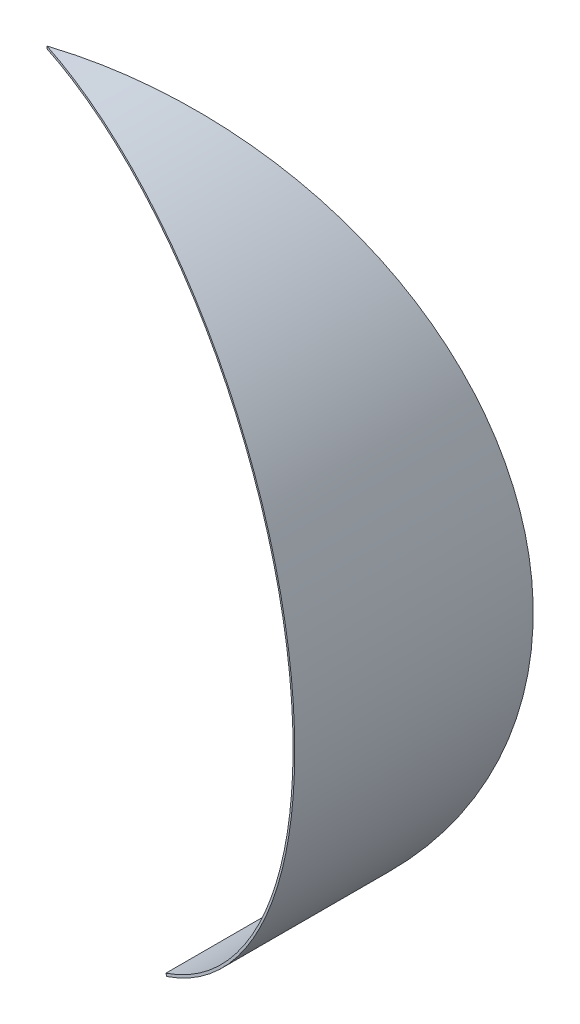
ISO-10303-21;
HEADER;
FILE_DESCRIPTION(('STEP AP214'),'2;1');
FILE_NAME('part.step','',(''),(''),'','','');
FILE_SCHEMA(('AUTOMOTIVE_DESIGN { 1 0 10303 214 1 1 1 1 }'));
ENDSEC;
DATA;
#1=APPLICATION_CONTEXT('core data for automotive mechanical design processes');
#2=APPLICATION_PROTOCOL_DEFINITION('international standard','automotive_design',2000,#1);
#3=PRODUCT_CONTEXT('',#1,'mechanical');
#4=PRODUCT('Part','Part','',(#3));
#5=PRODUCT_RELATED_PRODUCT_CATEGORY('part','',(#4));
#6=PRODUCT_DEFINITION_FORMATION('','',#4);
#7=PRODUCT_DEFINITION_CONTEXT('part definition',#1,'design');
#8=PRODUCT_DEFINITION('design','',#6,#7);
#9=PRODUCT_DEFINITION_SHAPE('','',#8);
#10=(LENGTH_UNIT() NAMED_UNIT(*) SI_UNIT(.MILLI.,.METRE.));
#11=(NAMED_UNIT(*) PLANE_ANGLE_UNIT() SI_UNIT($,.RADIAN.));
#12=(NAMED_UNIT(*) SI_UNIT($,.STERADIAN.) SOLID_ANGLE_UNIT());
#13=UNCERTAINTY_MEASURE_WITH_UNIT(LENGTH_MEASURE(1.E-05),#10,'distance_accuracy_value','');
#14=(GEOMETRIC_REPRESENTATION_CONTEXT(3) GLOBAL_UNCERTAINTY_ASSIGNED_CONTEXT((#13)) GLOBAL_UNIT_ASSIGNED_CONTEXT((#10,
#11,#12)) REPRESENTATION_CONTEXT('',''));
#15=CARTESIAN_POINT('',(0.,0.,0.));
#16=DIRECTION('',(0.,0.,1.));
#17=DIRECTION('',(1.,0.,0.));
#18=AXIS2_PLACEMENT_3D('',#15,#16,#17);
#19=CARTESIAN_POINT('',(0.,0.,1500.));
#20=DIRECTION('',(0.,0.,-1.));
#21=DIRECTION('',(-1.,0.,0.));
#22=AXIS2_PLACEMENT_3D('',#19,#20,#21);
#23=CYLINDRICAL_SURFACE('',#22,2980.);
#24=CARTESIAN_POINT('',(0.,0.,-6.66133814775094E-13));
#25=DIRECTION('',(-0.309016994374935,0.,-0.951056516295158));
#26=DIRECTION('',(0.951056516295158,0.,-0.309016994374935));
#27=AXIS2_PLACEMENT_3D('',#24,#25,#26);
#28=ELLIPSE('',#27,3133.35742823002,2980.);
#29=CARTESIAN_POINT('',(1440.33333333333,-2608.80046935155,-467.992669140776));
#30=VERTEX_POINT('',#29);
#31=CARTESIAN_POINT('',(1.83697019872103E-13,2980.,0.));
#32=VERTEX_POINT('',#31);
#33=EDGE_CURVE('E80',#30,#32,#28,.F.);
#34=ORIENTED_EDGE('',*,*,#33,.F.);
#35=DIRECTION('',(0.,0.,-1.));
#36=VECTOR('',#35,1.);
#37=CARTESIAN_POINT('',(1440.33333333333,-2608.80046935155,1500.));
#38=LINE('',#37,#36);
#39=CARTESIAN_POINT('',(1440.33333333333,-2608.80046935155,467.992669140819));
#40=VERTEX_POINT('',#39);
#41=EDGE_CURVE('E11',#40,#30,#38,.T.);
#42=ORIENTED_EDGE('',*,*,#41,.F.);
#43=CARTESIAN_POINT('',(0.,0.,-2.22044604925031E-13));
#44=DIRECTION('',(-0.309016994374961,0.,0.951056516295149));
#45=DIRECTION('',(-0.951056516295149,0.,-0.309016994374961));
#46=AXIS2_PLACEMENT_3D('',#43,#44,#45);
#47=ELLIPSE('',#46,3133.35742823005,2980.);
#48=EDGE_CURVE('E56',#32,#40,#47,.F.);
#49=ORIENTED_EDGE('',*,*,#48,.F.);
#50=EDGE_LOOP('',(#34,#42,#49));
#51=FACE_BOUND('',#50,.T.);
#52=ADVANCED_FACE('F41',(#51),#23,.F.);
#53=CARTESIAN_POINT('',(1440.33333333333,-2608.80046935155,1500.));
#54=DIRECTION('',(0.875436399111257,0.483333333333339,0.));
#55=DIRECTION('',(-0.483333333333339,0.875436399111257,0.));
#56=AXIS2_PLACEMENT_3D('',#53,#54,#55);
#57=PLANE('',#56);
#58=DIRECTION('',(-0.477481142451326,0.864836631705751,0.155143027762219));
#59=VECTOR('',#58,1.);
#60=CARTESIAN_POINT('',(1294.5486279537,-2344.74825378665,-420.624346953425));
#61=LINE('',#60,#59);
#62=CARTESIAN_POINT('',(1450.,-2626.30919733378,-471.133559537694));
#63=VERTEX_POINT('',#62);
#64=EDGE_CURVE('E89',#63,#30,#61,.T.);
#65=ORIENTED_EDGE('',*,*,#64,.F.);
#66=DIRECTION('',(0.,0.,-1.));
#67=VECTOR('',#66,1.);
#68=CARTESIAN_POINT('',(1450.,-2626.30919733378,1500.));
#69=LINE('',#68,#67);
#70=CARTESIAN_POINT('',(1450.,-2626.30919733378,471.133559537737));
#71=VERTEX_POINT('',#70);
#72=EDGE_CURVE('E49',#71,#63,#69,.T.);
#73=ORIENTED_EDGE('',*,*,#72,.F.);
#74=DIRECTION('',(0.477481142451324,-0.864836631705749,0.155143027762233));
#75=VECTOR('',#74,1.);
#76=CARTESIAN_POINT('',(1516.78223837149,-2747.26837447418,492.832424143157));
#77=LINE('',#76,#75);
#78=EDGE_CURVE('E60',#40,#71,#77,.T.);
#79=ORIENTED_EDGE('',*,*,#78,.F.);
#80=ORIENTED_EDGE('',*,*,#41,.T.);
#81=EDGE_LOOP('',(#65,#73,#79,#80));
#82=FACE_BOUND('',#81,.T.);
#83=ADVANCED_FACE('F106',(#82),#57,.F.);
#84=CARTESIAN_POINT('',(0.,0.,1500.));
#85=DIRECTION('',(0.,0.,-1.));
#86=DIRECTION('',(-1.,0.,0.));
#87=AXIS2_PLACEMENT_3D('',#84,#85,#86);
#88=CYLINDRICAL_SURFACE('',#87,3000.);
#89=CARTESIAN_POINT('',(0.,0.,-6.66133814775094E-13));
#90=DIRECTION('',(-0.309016994374935,0.,-0.951056516295158));
#91=DIRECTION('',(0.951056516295158,0.,-0.309016994374935));
#92=AXIS2_PLACEMENT_3D('',#89,#90,#91);
#93=ELLIPSE('',#92,3154.38667271479,3000.);
#94=CARTESIAN_POINT('',(0.,3000.,0.));
#95=VERTEX_POINT('',#94);
#96=EDGE_CURVE('E77',#95,#63,#93,.T.);
#97=ORIENTED_EDGE('',*,*,#96,.F.);
#98=CARTESIAN_POINT('',(0.,0.,-2.22044604925031E-13));
#99=DIRECTION('',(-0.309016994374961,0.,0.951056516295149));
#100=DIRECTION('',(-0.951056516295149,0.,-0.309016994374961));
#101=AXIS2_PLACEMENT_3D('',#98,#99,#100);
#102=ELLIPSE('',#101,3154.38667271482,3000.);
#103=EDGE_CURVE('E82',#71,#95,#102,.T.);
#104=ORIENTED_EDGE('',*,*,#103,.F.);
#105=ORIENTED_EDGE('',*,*,#72,.T.);
#106=EDGE_LOOP('',(#97,#104,#105));
#107=FACE_BOUND('',#106,.T.);
#108=ADVANCED_FACE('F86',(#107),#88,.T.);
#109=CARTESIAN_POINT('',(3541.10784825348,3457.99999999999,1150.57568638254));
#110=DIRECTION('',(-0.309016994374961,0.,0.951056516295149));
#111=DIRECTION('',(0.951056516295149,0.,0.309016994374961));
#112=AXIS2_PLACEMENT_3D('',#109,#110,#111);
#113=PLANE('',#112);
#114=ORIENTED_EDGE('',*,*,#48,.T.);
#115=ORIENTED_EDGE('',*,*,#78,.T.);
#116=ORIENTED_EDGE('',*,*,#103,.T.);
#117=DIRECTION('',(0.,-1.,0.));
#118=VECTOR('',#117,1.);
#119=CARTESIAN_POINT('',(1.83697019872103E-13,3457.99999999999,0.));
#120=LINE('',#119,#118);
#121=EDGE_CURVE('E74',#95,#32,#120,.T.);
#122=ORIENTED_EDGE('',*,*,#121,.T.);
#123=EDGE_LOOP('',(#114,#115,#116,#122));
#124=FACE_BOUND('',#123,.T.);
#125=ADVANCED_FACE('F91',(#124),#113,.T.);
#126=CARTESIAN_POINT('',(2853.16954888547,3457.99999999999,-927.050983124805));
#127=DIRECTION('',(-0.309016994374935,0.,-0.951056516295158));
#128=DIRECTION('',(-0.951056516295158,0.,0.309016994374935));
#129=AXIS2_PLACEMENT_3D('',#126,#127,#128);
#130=PLANE('',#129);
#131=ORIENTED_EDGE('',*,*,#33,.T.);
#132=ORIENTED_EDGE('',*,*,#121,.F.);
#133=ORIENTED_EDGE('',*,*,#96,.T.);
#134=ORIENTED_EDGE('',*,*,#64,.T.);
#135=EDGE_LOOP('',(#131,#132,#133,#134));
#136=FACE_BOUND('',#135,.T.);
#137=ADVANCED_FACE('F76',(#136),#130,.T.);
#138=CLOSED_SHELL('',(#52,#83,#108,#125,#137));
#139=MANIFOLD_SOLID_BREP('B2',#138);
#140=ADVANCED_BREP_SHAPE_REPRESENTATION('',(#18,#139),#14);
#141=SHAPE_DEFINITION_REPRESENTATION(#9,#140);
ENDSEC;
END-ISO-10303-21;
